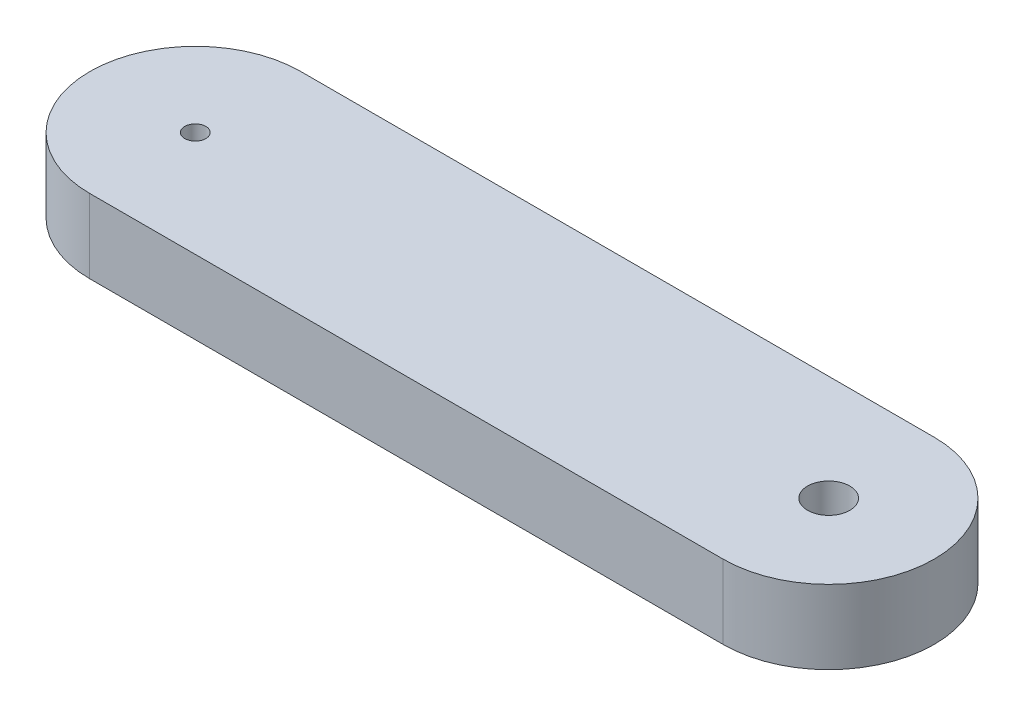
ISO-10303-21;
HEADER;
FILE_DESCRIPTION(('STEP AP214'),'2;1');
FILE_NAME('part.step','',(''),(''),'','','');
FILE_SCHEMA(('AUTOMOTIVE_DESIGN { 1 0 10303 214 1 1 1 1 }'));
ENDSEC;
DATA;
#1=APPLICATION_CONTEXT('core data for automotive mechanical design processes');
#2=APPLICATION_PROTOCOL_DEFINITION('international standard','automotive_design',2000,#1);
#3=PRODUCT_CONTEXT('',#1,'mechanical');
#4=PRODUCT('Part','Part','',(#3));
#5=PRODUCT_RELATED_PRODUCT_CATEGORY('part','',(#4));
#6=PRODUCT_DEFINITION_FORMATION('','',#4);
#7=PRODUCT_DEFINITION_CONTEXT('part definition',#1,'design');
#8=PRODUCT_DEFINITION('design','',#6,#7);
#9=PRODUCT_DEFINITION_SHAPE('','',#8);
#10=(LENGTH_UNIT() NAMED_UNIT(*) SI_UNIT(.MILLI.,.METRE.));
#11=(NAMED_UNIT(*) PLANE_ANGLE_UNIT() SI_UNIT($,.RADIAN.));
#12=(NAMED_UNIT(*) SI_UNIT($,.STERADIAN.) SOLID_ANGLE_UNIT());
#13=UNCERTAINTY_MEASURE_WITH_UNIT(LENGTH_MEASURE(1.E-05),#10,'distance_accuracy_value','');
#14=(GEOMETRIC_REPRESENTATION_CONTEXT(3) GLOBAL_UNCERTAINTY_ASSIGNED_CONTEXT((#13)) GLOBAL_UNIT_ASSIGNED_CONTEXT((#10,
#11,#12)) REPRESENTATION_CONTEXT('',''));
#15=CARTESIAN_POINT('',(0.,0.,0.));
#16=DIRECTION('',(0.,0.,1.));
#17=DIRECTION('',(1.,0.,0.));
#18=AXIS2_PLACEMENT_3D('',#15,#16,#17);
#19=CARTESIAN_POINT('',(0.,70.,0.));
#20=DIRECTION('',(0.,-1.,0.));
#21=DIRECTION('',(0.,0.,-1.));
#22=AXIS2_PLACEMENT_3D('',#19,#20,#21);
#23=CYLINDRICAL_SURFACE('',#22,100.);
#24=CARTESIAN_POINT('',(0.,0.,0.));
#25=DIRECTION('',(0.,1.,0.));
#26=DIRECTION('',(0.,0.,1.));
#27=AXIS2_PLACEMENT_3D('',#24,#25,#26);
#28=CIRCLE('',#27,100.);
#29=CARTESIAN_POINT('',(0.,0.,-100.));
#30=VERTEX_POINT('',#29);
#31=CARTESIAN_POINT('',(0.,0.,100.));
#32=VERTEX_POINT('',#31);
#33=EDGE_CURVE('E107',#30,#32,#28,.T.);
#34=ORIENTED_EDGE('',*,*,#33,.T.);
#35=DIRECTION('',(0.,-1.,0.));
#36=VECTOR('',#35,1.);
#37=CARTESIAN_POINT('',(0.,70.,100.));
#38=LINE('',#37,#36);
#39=CARTESIAN_POINT('',(0.,70.,100.));
#40=VERTEX_POINT('',#39);
#41=EDGE_CURVE('E11',#40,#32,#38,.T.);
#42=ORIENTED_EDGE('',*,*,#41,.F.);
#43=CARTESIAN_POINT('',(0.,70.,0.));
#44=DIRECTION('',(0.,1.,0.));
#45=DIRECTION('',(0.,0.,1.));
#46=AXIS2_PLACEMENT_3D('',#43,#44,#45);
#47=CIRCLE('',#46,100.);
#48=CARTESIAN_POINT('',(0.,70.,-100.));
#49=VERTEX_POINT('',#48);
#50=EDGE_CURVE('E89',#49,#40,#47,.T.);
#51=ORIENTED_EDGE('',*,*,#50,.F.);
#52=DIRECTION('',(0.,-1.,0.));
#53=VECTOR('',#52,1.);
#54=CARTESIAN_POINT('',(0.,70.,-100.));
#55=LINE('',#54,#53);
#56=EDGE_CURVE('E56',#49,#30,#55,.T.);
#57=ORIENTED_EDGE('',*,*,#56,.T.);
#58=EDGE_LOOP('',(#34,#42,#51,#57));
#59=FACE_BOUND('',#58,.T.);
#60=ADVANCED_FACE('F39',(#59),#23,.T.);
#61=CARTESIAN_POINT('',(0.,70.,100.));
#62=DIRECTION('',(0.,0.,-1.));
#63=DIRECTION('',(-1.,0.,0.));
#64=AXIS2_PLACEMENT_3D('',#61,#62,#63);
#65=PLANE('',#64);
#66=DIRECTION('',(1.,0.,0.));
#67=VECTOR('',#66,1.);
#68=CARTESIAN_POINT('',(0.,0.,100.));
#69=LINE('',#68,#67);
#70=CARTESIAN_POINT('',(600.,0.,100.));
#71=VERTEX_POINT('',#70);
#72=EDGE_CURVE('E95',#32,#71,#69,.T.);
#73=ORIENTED_EDGE('',*,*,#72,.T.);
#74=DIRECTION('',(0.,-1.,0.));
#75=VECTOR('',#74,1.);
#76=CARTESIAN_POINT('',(600.,70.,100.));
#77=LINE('',#76,#75);
#78=CARTESIAN_POINT('',(600.,70.,100.));
#79=VERTEX_POINT('',#78);
#80=EDGE_CURVE('E48',#79,#71,#77,.T.);
#81=ORIENTED_EDGE('',*,*,#80,.F.);
#82=DIRECTION('',(1.,0.,0.));
#83=VECTOR('',#82,1.);
#84=CARTESIAN_POINT('',(0.,70.,100.));
#85=LINE('',#84,#83);
#86=EDGE_CURVE('E82',#40,#79,#85,.T.);
#87=ORIENTED_EDGE('',*,*,#86,.F.);
#88=ORIENTED_EDGE('',*,*,#41,.T.);
#89=EDGE_LOOP('',(#73,#81,#87,#88));
#90=FACE_BOUND('',#89,.T.);
#91=ADVANCED_FACE('F94',(#90),#65,.F.);
#92=CARTESIAN_POINT('',(600.,70.,0.));
#93=DIRECTION('',(0.,-1.,0.));
#94=DIRECTION('',(0.,0.,-1.));
#95=AXIS2_PLACEMENT_3D('',#92,#93,#94);
#96=CYLINDRICAL_SURFACE('',#95,100.);
#97=CARTESIAN_POINT('',(600.,0.,0.));
#98=DIRECTION('',(0.,1.,0.));
#99=DIRECTION('',(0.,0.,1.));
#100=AXIS2_PLACEMENT_3D('',#97,#98,#99);
#101=CIRCLE('',#100,100.);
#102=CARTESIAN_POINT('',(600.,0.,-100.));
#103=VERTEX_POINT('',#102);
#104=EDGE_CURVE('E113',#71,#103,#101,.T.);
#105=ORIENTED_EDGE('',*,*,#104,.T.);
#106=DIRECTION('',(0.,-1.,0.));
#107=VECTOR('',#106,1.);
#108=CARTESIAN_POINT('',(600.,70.,-100.));
#109=LINE('',#108,#107);
#110=CARTESIAN_POINT('',(600.,70.,-100.));
#111=VERTEX_POINT('',#110);
#112=EDGE_CURVE('E71',#111,#103,#109,.T.);
#113=ORIENTED_EDGE('',*,*,#112,.F.);
#114=CARTESIAN_POINT('',(600.,70.,0.));
#115=DIRECTION('',(0.,1.,0.));
#116=DIRECTION('',(0.,0.,1.));
#117=AXIS2_PLACEMENT_3D('',#114,#115,#116);
#118=CIRCLE('',#117,100.);
#119=EDGE_CURVE('E88',#79,#111,#118,.T.);
#120=ORIENTED_EDGE('',*,*,#119,.F.);
#121=ORIENTED_EDGE('',*,*,#80,.T.);
#122=EDGE_LOOP('',(#105,#113,#120,#121));
#123=FACE_BOUND('',#122,.T.);
#124=ADVANCED_FACE('F99',(#123),#96,.T.);
#125=CARTESIAN_POINT('',(0.,70.,-100.));
#126=DIRECTION('',(0.,0.,-1.));
#127=DIRECTION('',(-1.,0.,0.));
#128=AXIS2_PLACEMENT_3D('',#125,#126,#127);
#129=PLANE('',#128);
#130=DIRECTION('',(1.,0.,0.));
#131=VECTOR('',#130,1.);
#132=CARTESIAN_POINT('',(0.,0.,-100.));
#133=LINE('',#132,#131);
#134=EDGE_CURVE('E116',#30,#103,#133,.T.);
#135=ORIENTED_EDGE('',*,*,#134,.F.);
#136=ORIENTED_EDGE('',*,*,#56,.F.);
#137=DIRECTION('',(1.,0.,0.));
#138=VECTOR('',#137,1.);
#139=CARTESIAN_POINT('',(0.,70.,-100.));
#140=LINE('',#139,#138);
#141=EDGE_CURVE('E101',#49,#111,#140,.T.);
#142=ORIENTED_EDGE('',*,*,#141,.T.);
#143=ORIENTED_EDGE('',*,*,#112,.T.);
#144=EDGE_LOOP('',(#135,#136,#142,#143));
#145=FACE_BOUND('',#144,.T.);
#146=ADVANCED_FACE('F153',(#145),#129,.T.);
#147=CARTESIAN_POINT('',(0.,70.,0.));
#148=DIRECTION('',(0.,1.,0.));
#149=DIRECTION('',(0.,0.,1.));
#150=AXIS2_PLACEMENT_3D('',#147,#148,#149);
#151=PLANE('',#150);
#152=CARTESIAN_POINT('',(600.,70.,0.));
#153=DIRECTION('',(0.,1.,0.));
#154=DIRECTION('',(0.,0.,1.));
#155=AXIS2_PLACEMENT_3D('',#152,#153,#154);
#156=CIRCLE('',#155,20.0000000000001);
#157=CARTESIAN_POINT('',(600.,70.,20.0000000000001));
#158=VERTEX_POINT('',#157);
#159=EDGE_CURVE('E134',#158,#158,#156,.T.);
#160=ORIENTED_EDGE('',*,*,#159,.F.);
#161=EDGE_LOOP('',(#160));
#162=FACE_BOUND('',#161,.T.);
#163=CARTESIAN_POINT('',(0.,70.,0.));
#164=DIRECTION('',(0.,1.,0.));
#165=DIRECTION('',(0.,0.,1.));
#166=AXIS2_PLACEMENT_3D('',#163,#164,#165);
#167=CIRCLE('',#166,10.);
#168=CARTESIAN_POINT('',(0.,70.,10.));
#169=VERTEX_POINT('',#168);
#170=EDGE_CURVE('E126',#169,#169,#167,.T.);
#171=ORIENTED_EDGE('',*,*,#170,.F.);
#172=EDGE_LOOP('',(#171));
#173=FACE_BOUND('',#172,.T.);
#174=ORIENTED_EDGE('',*,*,#50,.T.);
#175=ORIENTED_EDGE('',*,*,#86,.T.);
#176=ORIENTED_EDGE('',*,*,#119,.T.);
#177=ORIENTED_EDGE('',*,*,#141,.F.);
#178=EDGE_LOOP('',(#174,#175,#176,#177));
#179=FACE_BOUND('',#178,.T.);
#180=ADVANCED_FACE('F85',(#162,#173,#179),#151,.T.);
#181=CARTESIAN_POINT('',(0.,0.,0.));
#182=DIRECTION('',(0.,1.,0.));
#183=DIRECTION('',(0.,0.,1.));
#184=AXIS2_PLACEMENT_3D('',#181,#182,#183);
#185=PLANE('',#184);
#186=CARTESIAN_POINT('',(600.,0.,0.));
#187=DIRECTION('',(0.,1.,0.));
#188=DIRECTION('',(0.,0.,1.));
#189=AXIS2_PLACEMENT_3D('',#186,#187,#188);
#190=CIRCLE('',#189,20.0000000000001);
#191=CARTESIAN_POINT('',(600.,0.,20.0000000000001));
#192=VERTEX_POINT('',#191);
#193=EDGE_CURVE('E130',#192,#192,#190,.T.);
#194=ORIENTED_EDGE('',*,*,#193,.T.);
#195=EDGE_LOOP('',(#194));
#196=FACE_BOUND('',#195,.T.);
#197=ORIENTED_EDGE('',*,*,#33,.F.);
#198=ORIENTED_EDGE('',*,*,#134,.T.);
#199=ORIENTED_EDGE('',*,*,#104,.F.);
#200=ORIENTED_EDGE('',*,*,#72,.F.);
#201=EDGE_LOOP('',(#197,#198,#199,#200));
#202=FACE_BOUND('',#201,.T.);
#203=ADVANCED_FACE('F142',(#196,#202),#185,.F.);
#204=CARTESIAN_POINT('',(0.,50.,0.));
#205=DIRECTION('',(0.,1.,0.));
#206=DIRECTION('',(0.,0.,1.));
#207=AXIS2_PLACEMENT_3D('',#204,#205,#206);
#208=CYLINDRICAL_SURFACE('',#207,10.);
#209=CARTESIAN_POINT('',(0.,50.,0.));
#210=DIRECTION('',(0.,1.,0.));
#211=DIRECTION('',(0.,0.,1.));
#212=AXIS2_PLACEMENT_3D('',#209,#210,#211);
#213=CIRCLE('',#212,10.);
#214=CARTESIAN_POINT('',(0.,50.,10.));
#215=VERTEX_POINT('',#214);
#216=EDGE_CURVE('E110',#215,#215,#213,.T.);
#217=ORIENTED_EDGE('',*,*,#216,.F.);
#218=EDGE_LOOP('',(#217));
#219=FACE_BOUND('',#218,.T.);
#220=ORIENTED_EDGE('',*,*,#170,.T.);
#221=EDGE_LOOP('',(#220));
#222=FACE_BOUND('',#221,.T.);
#223=ADVANCED_FACE('F157',(#219,#222),#208,.F.);
#224=CARTESIAN_POINT('',(0.,50.,0.));
#225=DIRECTION('',(0.,1.,0.));
#226=DIRECTION('',(0.,0.,1.));
#227=AXIS2_PLACEMENT_3D('',#224,#225,#226);
#228=PLANE('',#227);
#229=ORIENTED_EDGE('',*,*,#216,.T.);
#230=EDGE_LOOP('',(#229));
#231=FACE_BOUND('',#230,.T.);
#232=ADVANCED_FACE('F147',(#231),#228,.T.);
#233=CARTESIAN_POINT('',(600.,0.,0.));
#234=DIRECTION('',(0.,1.,0.));
#235=DIRECTION('',(0.,0.,1.));
#236=AXIS2_PLACEMENT_3D('',#233,#234,#235);
#237=CYLINDRICAL_SURFACE('',#236,20.0000000000001);
#238=ORIENTED_EDGE('',*,*,#193,.F.);
#239=EDGE_LOOP('',(#238));
#240=FACE_BOUND('',#239,.T.);
#241=ORIENTED_EDGE('',*,*,#159,.T.);
#242=EDGE_LOOP('',(#241));
#243=FACE_BOUND('',#242,.T.);
#244=ADVANCED_FACE('F144',(#240,#243),#237,.F.);
#245=CLOSED_SHELL('',(#60,#91,#124,#146,#180,#203,#223,#232,#244));
#246=MANIFOLD_SOLID_BREP('B2',#245);
#247=ADVANCED_BREP_SHAPE_REPRESENTATION('',(#18,#246),#14);
#248=SHAPE_DEFINITION_REPRESENTATION(#9,#247);
ENDSEC;
END-ISO-10303-21;
